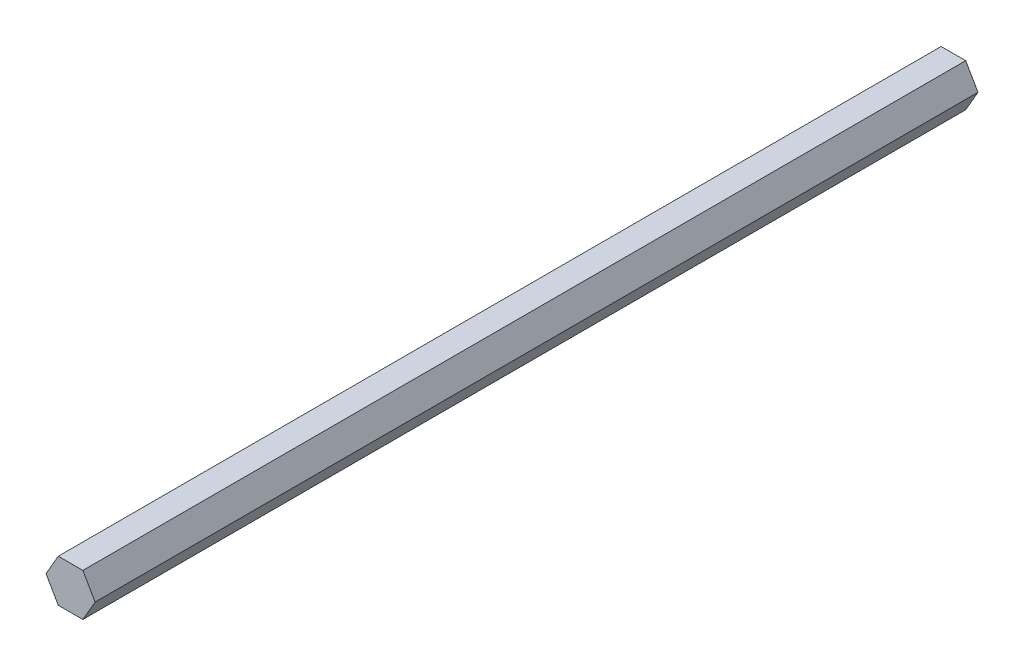
ISO-10303-21;
HEADER;
FILE_DESCRIPTION(('STEP AP214'),'2;1');
FILE_NAME('part.step','',(''),(''),'','','');
FILE_SCHEMA(('AUTOMOTIVE_DESIGN { 1 0 10303 214 1 1 1 1 }'));
ENDSEC;
DATA;
#1=APPLICATION_CONTEXT('core data for automotive mechanical design processes');
#2=APPLICATION_PROTOCOL_DEFINITION('international standard','automotive_design',2000,#1);
#3=PRODUCT_CONTEXT('',#1,'mechanical');
#4=PRODUCT('Part','Part','',(#3));
#5=PRODUCT_RELATED_PRODUCT_CATEGORY('part','',(#4));
#6=PRODUCT_DEFINITION_FORMATION('','',#4);
#7=PRODUCT_DEFINITION_CONTEXT('part definition',#1,'design');
#8=PRODUCT_DEFINITION('design','',#6,#7);
#9=PRODUCT_DEFINITION_SHAPE('','',#8);
#10=(LENGTH_UNIT() NAMED_UNIT(*) SI_UNIT(.MILLI.,.METRE.));
#11=(NAMED_UNIT(*) PLANE_ANGLE_UNIT() SI_UNIT($,.RADIAN.));
#12=(NAMED_UNIT(*) SI_UNIT($,.STERADIAN.) SOLID_ANGLE_UNIT());
#13=UNCERTAINTY_MEASURE_WITH_UNIT(LENGTH_MEASURE(1.E-05),#10,'distance_accuracy_value','');
#14=(GEOMETRIC_REPRESENTATION_CONTEXT(3) GLOBAL_UNCERTAINTY_ASSIGNED_CONTEXT((#13)) GLOBAL_UNIT_ASSIGNED_CONTEXT((#10,
#11,#12)) REPRESENTATION_CONTEXT('',''));
#15=CARTESIAN_POINT('',(0.,0.,0.));
#16=DIRECTION('',(0.,0.,1.));
#17=DIRECTION('',(1.,0.,0.));
#18=AXIS2_PLACEMENT_3D('',#15,#16,#17);
#19=CARTESIAN_POINT('',(3.6661742093542,-6.34999999999996,263.525));
#20=DIRECTION('',(-0.866025403784442,0.499999999999995,0.));
#21=DIRECTION('',(-0.499999999999995,-0.866025403784442,0.));
#22=AXIS2_PLACEMENT_3D('',#19,#20,#21);
#23=PLANE('',#22);
#24=DIRECTION('',(0.499999999999995,0.866025403784442,0.));
#25=VECTOR('',#24,1.);
#26=CARTESIAN_POINT('',(3.6661742093542,-6.34999999999996,0.));
#27=LINE('',#26,#25);
#28=CARTESIAN_POINT('',(3.6661742093542,-6.34999999999996,0.));
#29=VERTEX_POINT('',#28);
#30=CARTESIAN_POINT('',(7.33234841870825,0.,0.));
#31=VERTEX_POINT('',#30);
#32=EDGE_CURVE('E117',#29,#31,#27,.T.);
#33=ORIENTED_EDGE('',*,*,#32,.T.);
#34=DIRECTION('',(0.,0.,-1.));
#35=VECTOR('',#34,1.);
#36=CARTESIAN_POINT('',(7.33234841870825,0.,263.525));
#37=LINE('',#36,#35);
#38=CARTESIAN_POINT('',(7.33234841870825,0.,263.525));
#39=VERTEX_POINT('',#38);
#40=EDGE_CURVE('E11',#39,#31,#37,.T.);
#41=ORIENTED_EDGE('',*,*,#40,.F.);
#42=DIRECTION('',(0.499999999999995,0.866025403784442,0.));
#43=VECTOR('',#42,1.);
#44=CARTESIAN_POINT('',(3.6661742093542,-6.34999999999996,263.525));
#45=LINE('',#44,#43);
#46=CARTESIAN_POINT('',(3.6661742093542,-6.34999999999996,263.525));
#47=VERTEX_POINT('',#46);
#48=EDGE_CURVE('E127',#47,#39,#45,.T.);
#49=ORIENTED_EDGE('',*,*,#48,.F.);
#50=DIRECTION('',(0.,0.,-1.));
#51=VECTOR('',#50,1.);
#52=CARTESIAN_POINT('',(3.6661742093542,-6.34999999999996,263.525));
#53=LINE('',#52,#51);
#54=EDGE_CURVE('E113',#47,#29,#53,.T.);
#55=ORIENTED_EDGE('',*,*,#54,.T.);
#56=EDGE_LOOP('',(#33,#41,#49,#55));
#57=FACE_BOUND('',#56,.T.);
#58=ADVANCED_FACE('F33',(#57),#23,.F.);
#59=CARTESIAN_POINT('',(7.33234841870825,0.,263.525));
#60=DIRECTION('',(-0.866025403784438,-0.500000000000001,0.));
#61=DIRECTION('',(0.500000000000001,-0.866025403784438,0.));
#62=AXIS2_PLACEMENT_3D('',#59,#60,#61);
#63=PLANE('',#62);
#64=DIRECTION('',(-0.500000000000001,0.866025403784438,0.));
#65=VECTOR('',#64,1.);
#66=CARTESIAN_POINT('',(7.33234841870825,0.,0.));
#67=LINE('',#66,#65);
#68=CARTESIAN_POINT('',(3.66617420935411,6.35000000000001,0.));
#69=VERTEX_POINT('',#68);
#70=EDGE_CURVE('E120',#31,#69,#67,.T.);
#71=ORIENTED_EDGE('',*,*,#70,.T.);
#72=DIRECTION('',(0.,0.,-1.));
#73=VECTOR('',#72,1.);
#74=CARTESIAN_POINT('',(3.66617420935411,6.35000000000001,263.525));
#75=LINE('',#74,#73);
#76=CARTESIAN_POINT('',(3.66617420935411,6.35000000000001,263.525));
#77=VERTEX_POINT('',#76);
#78=EDGE_CURVE('E41',#77,#69,#75,.T.);
#79=ORIENTED_EDGE('',*,*,#78,.F.);
#80=DIRECTION('',(-0.500000000000001,0.866025403784438,0.));
#81=VECTOR('',#80,1.);
#82=CARTESIAN_POINT('',(7.33234841870825,0.,263.525));
#83=LINE('',#82,#81);
#84=EDGE_CURVE('E86',#39,#77,#83,.T.);
#85=ORIENTED_EDGE('',*,*,#84,.F.);
#86=ORIENTED_EDGE('',*,*,#40,.T.);
#87=EDGE_LOOP('',(#71,#79,#85,#86));
#88=FACE_BOUND('',#87,.T.);
#89=ADVANCED_FACE('F151',(#88),#63,.F.);
#90=CARTESIAN_POINT('',(3.66617420935411,6.35000000000001,263.525));
#91=DIRECTION('',(0.,-1.,0.));
#92=DIRECTION('',(1.,0.,0.));
#93=AXIS2_PLACEMENT_3D('',#90,#91,#92);
#94=PLANE('',#93);
#95=DIRECTION('',(-1.,0.,0.));
#96=VECTOR('',#95,1.);
#97=CARTESIAN_POINT('',(3.66617420935411,6.35000000000001,0.));
#98=LINE('',#97,#96);
#99=CARTESIAN_POINT('',(-3.66617420935416,6.34999999999999,0.));
#100=VERTEX_POINT('',#99);
#101=EDGE_CURVE('E122',#69,#100,#98,.T.);
#102=ORIENTED_EDGE('',*,*,#101,.T.);
#103=DIRECTION('',(0.,0.,-1.));
#104=VECTOR('',#103,1.);
#105=CARTESIAN_POINT('',(-3.66617420935416,6.34999999999999,263.525));
#106=LINE('',#105,#104);
#107=CARTESIAN_POINT('',(-3.66617420935416,6.34999999999999,263.525));
#108=VERTEX_POINT('',#107);
#109=EDGE_CURVE('E108',#108,#100,#106,.T.);
#110=ORIENTED_EDGE('',*,*,#109,.F.);
#111=DIRECTION('',(-1.,0.,0.));
#112=VECTOR('',#111,1.);
#113=CARTESIAN_POINT('',(3.66617420935411,6.35000000000001,263.525));
#114=LINE('',#113,#112);
#115=EDGE_CURVE('E99',#77,#108,#114,.T.);
#116=ORIENTED_EDGE('',*,*,#115,.F.);
#117=ORIENTED_EDGE('',*,*,#78,.T.);
#118=EDGE_LOOP('',(#102,#110,#116,#117));
#119=FACE_BOUND('',#118,.T.);
#120=ADVANCED_FACE('F133',(#119),#94,.F.);
#121=CARTESIAN_POINT('',(-3.66617420935416,6.34999999999999,263.525));
#122=DIRECTION('',(0.866025403784442,-0.499999999999995,0.));
#123=DIRECTION('',(0.499999999999995,0.866025403784442,0.));
#124=AXIS2_PLACEMENT_3D('',#121,#122,#123);
#125=PLANE('',#124);
#126=DIRECTION('',(-0.499999999999995,-0.866025403784442,0.));
#127=VECTOR('',#126,1.);
#128=CARTESIAN_POINT('',(-3.66617420935416,6.34999999999999,0.));
#129=LINE('',#128,#127);
#130=CARTESIAN_POINT('',(-7.33234841870825,0.,0.));
#131=VERTEX_POINT('',#130);
#132=EDGE_CURVE('E107',#100,#131,#129,.T.);
#133=ORIENTED_EDGE('',*,*,#132,.T.);
#134=DIRECTION('',(0.,0.,-1.));
#135=VECTOR('',#134,1.);
#136=CARTESIAN_POINT('',(-7.33234841870825,0.,263.525));
#137=LINE('',#136,#135);
#138=CARTESIAN_POINT('',(-7.33234841870825,0.,263.525));
#139=VERTEX_POINT('',#138);
#140=EDGE_CURVE('E104',#139,#131,#137,.T.);
#141=ORIENTED_EDGE('',*,*,#140,.F.);
#142=DIRECTION('',(-0.499999999999995,-0.866025403784442,0.));
#143=VECTOR('',#142,1.);
#144=CARTESIAN_POINT('',(-3.66617420935416,6.34999999999999,263.525));
#145=LINE('',#144,#143);
#146=EDGE_CURVE('E93',#108,#139,#145,.T.);
#147=ORIENTED_EDGE('',*,*,#146,.F.);
#148=ORIENTED_EDGE('',*,*,#109,.T.);
#149=EDGE_LOOP('',(#133,#141,#147,#148));
#150=FACE_BOUND('',#149,.T.);
#151=ADVANCED_FACE('F105',(#150),#125,.F.);
#152=CARTESIAN_POINT('',(-7.33234841870825,0.,263.525));
#153=DIRECTION('',(0.866025403784435,0.500000000000007,0.));
#154=DIRECTION('',(-0.500000000000007,0.866025403784435,0.));
#155=AXIS2_PLACEMENT_3D('',#152,#153,#154);
#156=PLANE('',#155);
#157=DIRECTION('',(0.500000000000007,-0.866025403784435,0.));
#158=VECTOR('',#157,1.);
#159=CARTESIAN_POINT('',(-7.33234841870825,0.,0.));
#160=LINE('',#159,#158);
#161=CARTESIAN_POINT('',(-3.66617420935407,-6.35000000000004,0.));
#162=VERTEX_POINT('',#161);
#163=EDGE_CURVE('E72',#131,#162,#160,.T.);
#164=ORIENTED_EDGE('',*,*,#163,.T.);
#165=DIRECTION('',(0.,0.,-1.));
#166=VECTOR('',#165,1.);
#167=CARTESIAN_POINT('',(-3.66617420935407,-6.35000000000004,263.525));
#168=LINE('',#167,#166);
#169=CARTESIAN_POINT('',(-3.66617420935407,-6.35000000000004,263.525));
#170=VERTEX_POINT('',#169);
#171=EDGE_CURVE('E109',#170,#162,#168,.T.);
#172=ORIENTED_EDGE('',*,*,#171,.F.);
#173=DIRECTION('',(0.500000000000007,-0.866025403784435,0.));
#174=VECTOR('',#173,1.);
#175=CARTESIAN_POINT('',(-7.33234841870825,0.,263.525));
#176=LINE('',#175,#174);
#177=EDGE_CURVE('E97',#139,#170,#176,.T.);
#178=ORIENTED_EDGE('',*,*,#177,.F.);
#179=ORIENTED_EDGE('',*,*,#140,.T.);
#180=EDGE_LOOP('',(#164,#172,#178,#179));
#181=FACE_BOUND('',#180,.T.);
#182=ADVANCED_FACE('F111',(#181),#156,.F.);
#183=CARTESIAN_POINT('',(-3.66617420935407,-6.35000000000004,263.525));
#184=DIRECTION('',(0.,1.,0.));
#185=DIRECTION('',(-1.,0.,0.));
#186=AXIS2_PLACEMENT_3D('',#183,#184,#185);
#187=PLANE('',#186);
#188=DIRECTION('',(1.,0.,0.));
#189=VECTOR('',#188,1.);
#190=CARTESIAN_POINT('',(-3.66617420935407,-6.35000000000004,0.));
#191=LINE('',#190,#189);
#192=EDGE_CURVE('E78',#162,#29,#191,.T.);
#193=ORIENTED_EDGE('',*,*,#192,.T.);
#194=ORIENTED_EDGE('',*,*,#54,.F.);
#195=DIRECTION('',(1.,0.,0.));
#196=VECTOR('',#195,1.);
#197=CARTESIAN_POINT('',(-3.66617420935407,-6.35000000000004,263.525));
#198=LINE('',#197,#196);
#199=EDGE_CURVE('E49',#170,#47,#198,.T.);
#200=ORIENTED_EDGE('',*,*,#199,.F.);
#201=ORIENTED_EDGE('',*,*,#171,.T.);
#202=EDGE_LOOP('',(#193,#194,#200,#201));
#203=FACE_BOUND('',#202,.T.);
#204=ADVANCED_FACE('F140',(#203),#187,.F.);
#205=CARTESIAN_POINT('',(0.,0.,263.525));
#206=DIRECTION('',(0.,0.,1.));
#207=DIRECTION('',(1.,0.,0.));
#208=AXIS2_PLACEMENT_3D('',#205,#206,#207);
#209=PLANE('',#208);
#210=ORIENTED_EDGE('',*,*,#48,.T.);
#211=ORIENTED_EDGE('',*,*,#84,.T.);
#212=ORIENTED_EDGE('',*,*,#115,.T.);
#213=ORIENTED_EDGE('',*,*,#146,.T.);
#214=ORIENTED_EDGE('',*,*,#177,.T.);
#215=ORIENTED_EDGE('',*,*,#199,.T.);
#216=EDGE_LOOP('',(#210,#211,#212,#213,#214,#215));
#217=FACE_BOUND('',#216,.T.);
#218=ADVANCED_FACE('F95',(#217),#209,.T.);
#219=CARTESIAN_POINT('',(0.,0.,0.));
#220=DIRECTION('',(0.,0.,1.));
#221=DIRECTION('',(1.,0.,0.));
#222=AXIS2_PLACEMENT_3D('',#219,#220,#221);
#223=PLANE('',#222);
#224=ORIENTED_EDGE('',*,*,#32,.F.);
#225=ORIENTED_EDGE('',*,*,#192,.F.);
#226=ORIENTED_EDGE('',*,*,#163,.F.);
#227=ORIENTED_EDGE('',*,*,#132,.F.);
#228=ORIENTED_EDGE('',*,*,#101,.F.);
#229=ORIENTED_EDGE('',*,*,#70,.F.);
#230=EDGE_LOOP('',(#224,#225,#226,#227,#228,#229));
#231=FACE_BOUND('',#230,.T.);
#232=ADVANCED_FACE('F136',(#231),#223,.F.);
#233=CLOSED_SHELL('',(#58,#89,#120,#151,#182,#204,#218,#232));
#234=MANIFOLD_SOLID_BREP('B2',#233);
#235=ADVANCED_BREP_SHAPE_REPRESENTATION('',(#18,#234),#14);
#236=SHAPE_DEFINITION_REPRESENTATION(#9,#235);
ENDSEC;
END-ISO-10303-21;
